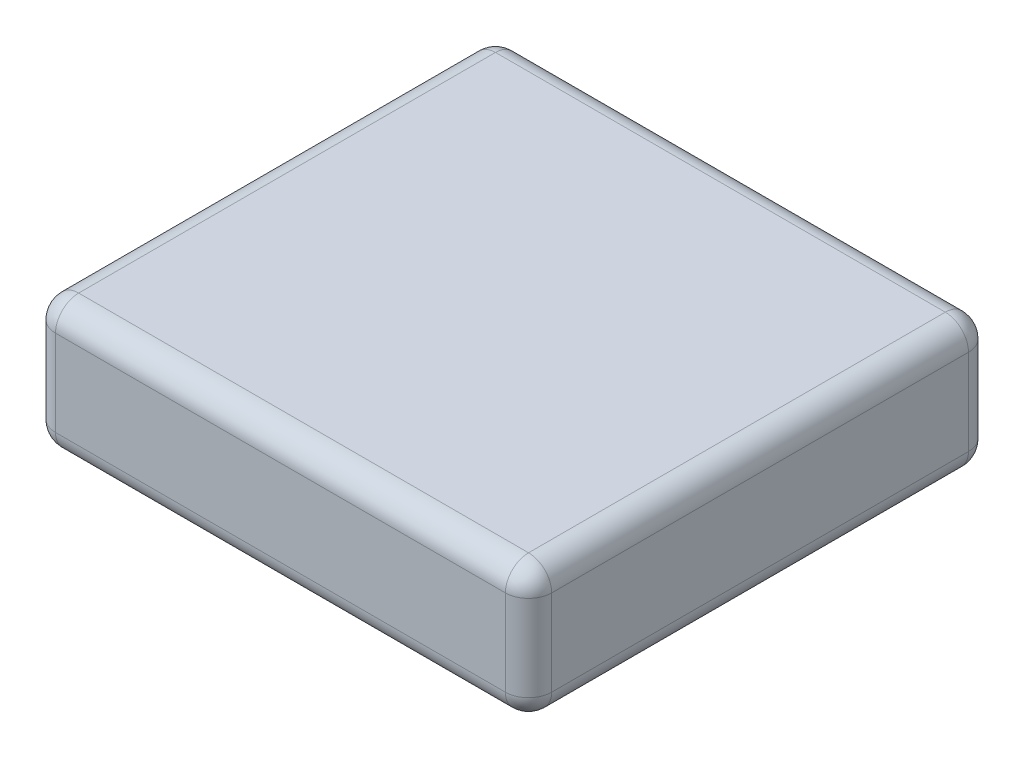
ISO-10303-21;
HEADER;
FILE_DESCRIPTION(('STEP AP214'),'2;1');
FILE_NAME('part.step','',(''),(''),'','','');
FILE_SCHEMA(('AUTOMOTIVE_DESIGN { 1 0 10303 214 1 1 1 1 }'));
ENDSEC;
DATA;
#1=APPLICATION_CONTEXT('core data for automotive mechanical design processes');
#2=APPLICATION_PROTOCOL_DEFINITION('international standard','automotive_design',2000,#1);
#3=PRODUCT_CONTEXT('',#1,'mechanical');
#4=PRODUCT('Part','Part','',(#3));
#5=PRODUCT_RELATED_PRODUCT_CATEGORY('part','',(#4));
#6=PRODUCT_DEFINITION_FORMATION('','',#4);
#7=PRODUCT_DEFINITION_CONTEXT('part definition',#1,'design');
#8=PRODUCT_DEFINITION('design','',#6,#7);
#9=PRODUCT_DEFINITION_SHAPE('','',#8);
#10=(LENGTH_UNIT() NAMED_UNIT(*) SI_UNIT(.MILLI.,.METRE.));
#11=(NAMED_UNIT(*) PLANE_ANGLE_UNIT() SI_UNIT($,.RADIAN.));
#12=(NAMED_UNIT(*) SI_UNIT($,.STERADIAN.) SOLID_ANGLE_UNIT());
#13=UNCERTAINTY_MEASURE_WITH_UNIT(LENGTH_MEASURE(1.E-05),#10,'distance_accuracy_value','');
#14=(GEOMETRIC_REPRESENTATION_CONTEXT(3) GLOBAL_UNCERTAINTY_ASSIGNED_CONTEXT((#13)) GLOBAL_UNIT_ASSIGNED_CONTEXT((#10,
#11,#12)) REPRESENTATION_CONTEXT('',''));
#15=CARTESIAN_POINT('',(0.,0.,0.));
#16=DIRECTION('',(0.,0.,1.));
#17=DIRECTION('',(1.,0.,0.));
#18=AXIS2_PLACEMENT_3D('',#15,#16,#17);
#19=CARTESIAN_POINT('',(506.552706552706,200.,-350.));
#20=DIRECTION('',(-1.,0.,0.));
#21=DIRECTION('',(0.,0.,1.));
#22=AXIS2_PLACEMENT_3D('',#19,#20,#21);
#23=PLANE('',#22);
#24=DIRECTION('',(0.,-1.,0.));
#25=VECTOR('',#24,1.);
#26=CARTESIAN_POINT('',(506.552706552706,200.,-315.));
#27=LINE('',#26,#25);
#28=CARTESIAN_POINT('',(506.552706552706,35.,-315.));
#29=VERTEX_POINT('',#28);
#30=CARTESIAN_POINT('',(506.552706552706,165.,-315.));
#31=VERTEX_POINT('',#30);
#32=EDGE_CURVE('E142',#29,#31,#27,.F.);
#33=ORIENTED_EDGE('',*,*,#32,.T.);
#34=DIRECTION('',(0.,0.,-1.));
#35=VECTOR('',#34,1.);
#36=CARTESIAN_POINT('',(506.552706552706,165.,350.));
#37=LINE('',#36,#35);
#38=CARTESIAN_POINT('',(506.552706552706,165.,315.));
#39=VERTEX_POINT('',#38);
#40=EDGE_CURVE('E188',#31,#39,#37,.F.);
#41=ORIENTED_EDGE('',*,*,#40,.T.);
#42=DIRECTION('',(0.,-1.,0.));
#43=VECTOR('',#42,1.);
#44=CARTESIAN_POINT('',(506.552706552706,200.,315.));
#45=LINE('',#44,#43);
#46=CARTESIAN_POINT('',(506.552706552706,35.,315.));
#47=VERTEX_POINT('',#46);
#48=EDGE_CURVE('E183',#39,#47,#45,.T.);
#49=ORIENTED_EDGE('',*,*,#48,.T.);
#50=DIRECTION('',(0.,0.,-1.));
#51=VECTOR('',#50,1.);
#52=CARTESIAN_POINT('',(506.552706552706,35.,-350.));
#53=LINE('',#52,#51);
#54=EDGE_CURVE('E177',#47,#29,#53,.T.);
#55=ORIENTED_EDGE('',*,*,#54,.T.);
#56=EDGE_LOOP('',(#33,#41,#49,#55));
#57=FACE_BOUND('',#56,.T.);
#58=ADVANCED_FACE('F45',(#57),#23,.F.);
#59=CARTESIAN_POINT('',(-243.447293447294,200.,-350.));
#60=DIRECTION('',(0.,0.,1.));
#61=DIRECTION('',(1.,0.,0.));
#62=AXIS2_PLACEMENT_3D('',#59,#60,#61);
#63=PLANE('',#62);
#64=DIRECTION('',(0.,-1.,0.));
#65=VECTOR('',#64,1.);
#66=CARTESIAN_POINT('',(-208.447293447294,200.,-350.));
#67=LINE('',#66,#65);
#68=CARTESIAN_POINT('',(-208.447293447294,35.,-350.));
#69=VERTEX_POINT('',#68);
#70=CARTESIAN_POINT('',(-208.447293447294,165.,-350.));
#71=VERTEX_POINT('',#70);
#72=EDGE_CURVE('E167',#69,#71,#67,.F.);
#73=ORIENTED_EDGE('',*,*,#72,.T.);
#74=DIRECTION('',(-1.,0.,0.));
#75=VECTOR('',#74,1.);
#76=CARTESIAN_POINT('',(506.552706552706,165.,-350.));
#77=LINE('',#76,#75);
#78=CARTESIAN_POINT('',(471.552706552706,165.,-350.));
#79=VERTEX_POINT('',#78);
#80=EDGE_CURVE('E171',#71,#79,#77,.F.);
#81=ORIENTED_EDGE('',*,*,#80,.T.);
#82=DIRECTION('',(0.,-1.,0.));
#83=VECTOR('',#82,1.);
#84=CARTESIAN_POINT('',(471.552706552706,200.,-350.));
#85=LINE('',#84,#83);
#86=CARTESIAN_POINT('',(471.552706552706,35.,-350.));
#87=VERTEX_POINT('',#86);
#88=EDGE_CURVE('E140',#79,#87,#85,.T.);
#89=ORIENTED_EDGE('',*,*,#88,.T.);
#90=DIRECTION('',(-1.,0.,0.));
#91=VECTOR('',#90,1.);
#92=CARTESIAN_POINT('',(-243.447293447294,35.,-350.));
#93=LINE('',#92,#91);
#94=EDGE_CURVE('E160',#87,#69,#93,.T.);
#95=ORIENTED_EDGE('',*,*,#94,.T.);
#96=EDGE_LOOP('',(#73,#81,#89,#95));
#97=FACE_BOUND('',#96,.T.);
#98=ADVANCED_FACE('F169',(#97),#63,.F.);
#99=CARTESIAN_POINT('',(-243.447293447294,200.,-350.));
#100=DIRECTION('',(1.,0.,0.));
#101=DIRECTION('',(0.,0.,-1.));
#102=AXIS2_PLACEMENT_3D('',#99,#100,#101);
#103=PLANE('',#102);
#104=DIRECTION('',(0.,-1.,0.));
#105=VECTOR('',#104,1.);
#106=CARTESIAN_POINT('',(-243.447293447294,200.,315.));
#107=LINE('',#106,#105);
#108=CARTESIAN_POINT('',(-243.447293447294,35.,315.));
#109=VERTEX_POINT('',#108);
#110=CARTESIAN_POINT('',(-243.447293447294,165.,315.));
#111=VERTEX_POINT('',#110);
#112=EDGE_CURVE('E194',#109,#111,#107,.F.);
#113=ORIENTED_EDGE('',*,*,#112,.T.);
#114=DIRECTION('',(0.,0.,1.));
#115=VECTOR('',#114,1.);
#116=CARTESIAN_POINT('',(-243.447293447294,165.,-350.));
#117=LINE('',#116,#115);
#118=CARTESIAN_POINT('',(-243.447293447294,165.,-315.));
#119=VERTEX_POINT('',#118);
#120=EDGE_CURVE('E201',#111,#119,#117,.F.);
#121=ORIENTED_EDGE('',*,*,#120,.T.);
#122=DIRECTION('',(0.,-1.,0.));
#123=VECTOR('',#122,1.);
#124=CARTESIAN_POINT('',(-243.447293447294,200.,-315.));
#125=LINE('',#124,#123);
#126=CARTESIAN_POINT('',(-243.447293447294,35.,-315.));
#127=VERTEX_POINT('',#126);
#128=EDGE_CURVE('E197',#119,#127,#125,.T.);
#129=ORIENTED_EDGE('',*,*,#128,.T.);
#130=DIRECTION('',(0.,0.,1.));
#131=VECTOR('',#130,1.);
#132=CARTESIAN_POINT('',(-243.447293447294,35.,-350.));
#133=LINE('',#132,#131);
#134=EDGE_CURVE('E191',#127,#109,#133,.T.);
#135=ORIENTED_EDGE('',*,*,#134,.T.);
#136=EDGE_LOOP('',(#113,#121,#129,#135));
#137=FACE_BOUND('',#136,.T.);
#138=ADVANCED_FACE('F340',(#137),#103,.F.);
#139=CARTESIAN_POINT('',(-243.447293447294,200.,350.));
#140=DIRECTION('',(0.,0.,-1.));
#141=DIRECTION('',(-1.,0.,0.));
#142=AXIS2_PLACEMENT_3D('',#139,#140,#141);
#143=PLANE('',#142);
#144=DIRECTION('',(0.,-1.,0.));
#145=VECTOR('',#144,1.);
#146=CARTESIAN_POINT('',(471.552706552706,200.,350.));
#147=LINE('',#146,#145);
#148=CARTESIAN_POINT('',(471.552706552706,35.,350.));
#149=VERTEX_POINT('',#148);
#150=CARTESIAN_POINT('',(471.552706552706,165.,350.));
#151=VERTEX_POINT('',#150);
#152=EDGE_CURVE('E207',#149,#151,#147,.F.);
#153=ORIENTED_EDGE('',*,*,#152,.T.);
#154=DIRECTION('',(1.,0.,0.));
#155=VECTOR('',#154,1.);
#156=CARTESIAN_POINT('',(-243.447293447294,165.,350.));
#157=LINE('',#156,#155);
#158=CARTESIAN_POINT('',(-208.447293447294,165.,350.));
#159=VERTEX_POINT('',#158);
#160=EDGE_CURVE('E214',#151,#159,#157,.F.);
#161=ORIENTED_EDGE('',*,*,#160,.T.);
#162=DIRECTION('',(0.,-1.,0.));
#163=VECTOR('',#162,1.);
#164=CARTESIAN_POINT('',(-208.447293447294,200.,350.));
#165=LINE('',#164,#163);
#166=CARTESIAN_POINT('',(-208.447293447294,35.,350.));
#167=VERTEX_POINT('',#166);
#168=EDGE_CURVE('E210',#159,#167,#165,.T.);
#169=ORIENTED_EDGE('',*,*,#168,.T.);
#170=DIRECTION('',(1.,0.,0.));
#171=VECTOR('',#170,1.);
#172=CARTESIAN_POINT('',(-243.447293447294,35.,350.));
#173=LINE('',#172,#171);
#174=EDGE_CURVE('E204',#167,#149,#173,.T.);
#175=ORIENTED_EDGE('',*,*,#174,.T.);
#176=EDGE_LOOP('',(#153,#161,#169,#175));
#177=FACE_BOUND('',#176,.T.);
#178=ADVANCED_FACE('F351',(#177),#143,.F.);
#179=CARTESIAN_POINT('',(0.,200.,0.));
#180=DIRECTION('',(0.,1.,0.));
#181=DIRECTION('',(0.,0.,1.));
#182=AXIS2_PLACEMENT_3D('',#179,#180,#181);
#183=PLANE('',#182);
#184=DIRECTION('',(0.,0.,1.));
#185=VECTOR('',#184,1.);
#186=CARTESIAN_POINT('',(-208.447293447294,200.,350.));
#187=LINE('',#186,#185);
#188=CARTESIAN_POINT('',(-208.447293447294,200.,-315.));
#189=VERTEX_POINT('',#188);
#190=CARTESIAN_POINT('',(-208.447293447294,200.,315.));
#191=VERTEX_POINT('',#190);
#192=EDGE_CURVE('E223',#189,#191,#187,.T.);
#193=ORIENTED_EDGE('',*,*,#192,.T.);
#194=DIRECTION('',(1.,0.,0.));
#195=VECTOR('',#194,1.);
#196=CARTESIAN_POINT('',(506.552706552706,200.,315.));
#197=LINE('',#196,#195);
#198=CARTESIAN_POINT('',(471.552706552706,200.,315.));
#199=VERTEX_POINT('',#198);
#200=EDGE_CURVE('E226',#191,#199,#197,.T.);
#201=ORIENTED_EDGE('',*,*,#200,.T.);
#202=DIRECTION('',(0.,0.,-1.));
#203=VECTOR('',#202,1.);
#204=CARTESIAN_POINT('',(471.552706552706,200.,-350.));
#205=LINE('',#204,#203);
#206=CARTESIAN_POINT('',(471.552706552706,200.,-315.));
#207=VERTEX_POINT('',#206);
#208=EDGE_CURVE('E217',#199,#207,#205,.T.);
#209=ORIENTED_EDGE('',*,*,#208,.T.);
#210=DIRECTION('',(-1.,0.,0.));
#211=VECTOR('',#210,1.);
#212=CARTESIAN_POINT('',(-243.447293447294,200.,-315.));
#213=LINE('',#212,#211);
#214=EDGE_CURVE('E220',#207,#189,#213,.T.);
#215=ORIENTED_EDGE('',*,*,#214,.T.);
#216=EDGE_LOOP('',(#193,#201,#209,#215));
#217=FACE_BOUND('',#216,.T.);
#218=ADVANCED_FACE('F332',(#217),#183,.T.);
#219=CARTESIAN_POINT('',(0.,0.,0.));
#220=DIRECTION('',(0.,1.,0.));
#221=DIRECTION('',(0.,0.,1.));
#222=AXIS2_PLACEMENT_3D('',#219,#220,#221);
#223=PLANE('',#222);
#224=DIRECTION('',(0.,0.,1.));
#225=VECTOR('',#224,1.);
#226=CARTESIAN_POINT('',(-208.447293447294,0.,0.));
#227=LINE('',#226,#225);
#228=CARTESIAN_POINT('',(-208.447293447294,0.,315.));
#229=VERTEX_POINT('',#228);
#230=CARTESIAN_POINT('',(-208.447293447294,0.,-315.));
#231=VERTEX_POINT('',#230);
#232=EDGE_CURVE('E55',#229,#231,#227,.F.);
#233=ORIENTED_EDGE('',*,*,#232,.T.);
#234=DIRECTION('',(-1.,0.,0.));
#235=VECTOR('',#234,1.);
#236=CARTESIAN_POINT('',(0.,0.,-315.));
#237=LINE('',#236,#235);
#238=CARTESIAN_POINT('',(471.552706552706,0.,-315.));
#239=VERTEX_POINT('',#238);
#240=EDGE_CURVE('E11',#231,#239,#237,.F.);
#241=ORIENTED_EDGE('',*,*,#240,.T.);
#242=DIRECTION('',(0.,0.,-1.));
#243=VECTOR('',#242,1.);
#244=CARTESIAN_POINT('',(471.552706552706,0.,0.));
#245=LINE('',#244,#243);
#246=CARTESIAN_POINT('',(471.552706552706,0.,315.));
#247=VERTEX_POINT('',#246);
#248=EDGE_CURVE('E230',#239,#247,#245,.F.);
#249=ORIENTED_EDGE('',*,*,#248,.T.);
#250=DIRECTION('',(1.,0.,0.));
#251=VECTOR('',#250,1.);
#252=CARTESIAN_POINT('',(0.,0.,315.));
#253=LINE('',#252,#251);
#254=EDGE_CURVE('E66',#247,#229,#253,.F.);
#255=ORIENTED_EDGE('',*,*,#254,.T.);
#256=EDGE_LOOP('',(#233,#241,#249,#255));
#257=FACE_BOUND('',#256,.T.);
#258=ADVANCED_FACE('F577',(#257),#223,.F.);
#259=CARTESIAN_POINT('',(-208.447293447294,200.,315.));
#260=DIRECTION('',(0.,-1.,0.));
#261=DIRECTION('',(0.,0.,-1.));
#262=AXIS2_PLACEMENT_3D('',#259,#260,#261);
#263=CYLINDRICAL_SURFACE('',#262,35.);
#264=CARTESIAN_POINT('',(-208.447293447294,165.,315.));
#265=DIRECTION('',(0.,1.,0.));
#266=DIRECTION('',(0.,0.,1.));
#267=AXIS2_PLACEMENT_3D('',#264,#265,#266);
#268=CIRCLE('',#267,35.);
#269=EDGE_CURVE('E49',#111,#159,#268,.T.);
#270=ORIENTED_EDGE('',*,*,#269,.F.);
#271=ORIENTED_EDGE('',*,*,#112,.F.);
#272=CARTESIAN_POINT('',(-208.447293447294,35.,315.));
#273=DIRECTION('',(0.,-1.,0.));
#274=DIRECTION('',(0.,0.,-1.));
#275=AXIS2_PLACEMENT_3D('',#272,#273,#274);
#276=CIRCLE('',#275,35.);
#277=EDGE_CURVE('E307',#167,#109,#276,.T.);
#278=ORIENTED_EDGE('',*,*,#277,.F.);
#279=ORIENTED_EDGE('',*,*,#168,.F.);
#280=EDGE_LOOP('',(#270,#271,#278,#279));
#281=FACE_BOUND('',#280,.T.);
#282=ADVANCED_FACE('F47',(#281),#263,.T.);
#283=CARTESIAN_POINT('',(-208.447293447294,165.,315.));
#284=DIRECTION('',(0.,0.,1.));
#285=DIRECTION('',(1.,0.,0.));
#286=AXIS2_PLACEMENT_3D('',#283,#284,#285);
#287=SPHERICAL_SURFACE('',#286,35.);
#288=CARTESIAN_POINT('',(-208.447293447294,165.,315.));
#289=DIRECTION('',(0.,0.,1.));
#290=DIRECTION('',(1.,0.,0.));
#291=AXIS2_PLACEMENT_3D('',#288,#289,#290);
#292=CIRCLE('',#291,35.);
#293=EDGE_CURVE('E300',#111,#191,#292,.F.);
#294=ORIENTED_EDGE('',*,*,#293,.F.);
#295=ORIENTED_EDGE('',*,*,#269,.T.);
#296=CARTESIAN_POINT('',(-208.447293447294,165.,315.));
#297=DIRECTION('',(-1.,0.,0.));
#298=DIRECTION('',(0.,0.,1.));
#299=AXIS2_PLACEMENT_3D('',#296,#297,#298);
#300=CIRCLE('',#299,35.);
#301=EDGE_CURVE('E304',#191,#159,#300,.F.);
#302=ORIENTED_EDGE('',*,*,#301,.F.);
#303=EDGE_LOOP('',(#294,#295,#302));
#304=FACE_BOUND('',#303,.T.);
#305=ADVANCED_FACE('F320',(#304),#287,.T.);
#306=CARTESIAN_POINT('',(-208.447293447294,35.,315.));
#307=DIRECTION('',(-1.,0.,0.));
#308=DIRECTION('',(0.,0.,1.));
#309=AXIS2_PLACEMENT_3D('',#306,#307,#308);
#310=SPHERICAL_SURFACE('',#309,35.);
#311=CARTESIAN_POINT('',(-208.447293447294,35.,315.));
#312=DIRECTION('',(-1.,0.,0.));
#313=DIRECTION('',(0.,0.,1.));
#314=AXIS2_PLACEMENT_3D('',#311,#312,#313);
#315=CIRCLE('',#314,35.);
#316=EDGE_CURVE('E293',#167,#229,#315,.F.);
#317=ORIENTED_EDGE('',*,*,#316,.F.);
#318=ORIENTED_EDGE('',*,*,#277,.T.);
#319=CARTESIAN_POINT('',(-208.447293447294,35.,315.));
#320=DIRECTION('',(0.,0.,1.));
#321=DIRECTION('',(1.,0.,0.));
#322=AXIS2_PLACEMENT_3D('',#319,#320,#321);
#323=CIRCLE('',#322,35.);
#324=EDGE_CURVE('E296',#229,#109,#323,.F.);
#325=ORIENTED_EDGE('',*,*,#324,.F.);
#326=EDGE_LOOP('',(#317,#318,#325));
#327=FACE_BOUND('',#326,.T.);
#328=ADVANCED_FACE('F550',(#327),#310,.T.);
#329=CARTESIAN_POINT('',(0.,165.,315.));
#330=DIRECTION('',(-1.,0.,0.));
#331=DIRECTION('',(0.,0.,1.));
#332=AXIS2_PLACEMENT_3D('',#329,#330,#331);
#333=CYLINDRICAL_SURFACE('',#332,35.);
#334=ORIENTED_EDGE('',*,*,#301,.T.);
#335=ORIENTED_EDGE('',*,*,#160,.F.);
#336=CARTESIAN_POINT('',(471.552706552706,165.,315.));
#337=DIRECTION('',(1.,0.,0.));
#338=DIRECTION('',(0.,0.,-1.));
#339=AXIS2_PLACEMENT_3D('',#336,#337,#338);
#340=CIRCLE('',#339,35.);
#341=EDGE_CURVE('E285',#199,#151,#340,.T.);
#342=ORIENTED_EDGE('',*,*,#341,.F.);
#343=ORIENTED_EDGE('',*,*,#200,.F.);
#344=EDGE_LOOP('',(#334,#335,#342,#343));
#345=FACE_BOUND('',#344,.T.);
#346=ADVANCED_FACE('F328',(#345),#333,.T.);
#347=CARTESIAN_POINT('',(-208.447293447294,165.,0.));
#348=DIRECTION('',(0.,0.,-1.));
#349=DIRECTION('',(-1.,0.,0.));
#350=AXIS2_PLACEMENT_3D('',#347,#348,#349);
#351=CYLINDRICAL_SURFACE('',#350,35.);
#352=ORIENTED_EDGE('',*,*,#293,.T.);
#353=ORIENTED_EDGE('',*,*,#192,.F.);
#354=CARTESIAN_POINT('',(-208.447293447294,165.,-315.));
#355=DIRECTION('',(0.,0.,-1.));
#356=DIRECTION('',(-1.,0.,0.));
#357=AXIS2_PLACEMENT_3D('',#354,#355,#356);
#358=CIRCLE('',#357,35.);
#359=EDGE_CURVE('E281',#119,#189,#358,.T.);
#360=ORIENTED_EDGE('',*,*,#359,.F.);
#361=ORIENTED_EDGE('',*,*,#120,.F.);
#362=EDGE_LOOP('',(#352,#353,#360,#361));
#363=FACE_BOUND('',#362,.T.);
#364=ADVANCED_FACE('F337',(#363),#351,.T.);
#365=CARTESIAN_POINT('',(-208.447293447294,200.,-315.));
#366=DIRECTION('',(0.,-1.,0.));
#367=DIRECTION('',(0.,0.,-1.));
#368=AXIS2_PLACEMENT_3D('',#365,#366,#367);
#369=CYLINDRICAL_SURFACE('',#368,35.);
#370=CARTESIAN_POINT('',(-208.447293447294,35.,-315.));
#371=DIRECTION('',(0.,-1.,0.));
#372=DIRECTION('',(0.,0.,-1.));
#373=AXIS2_PLACEMENT_3D('',#370,#371,#372);
#374=CIRCLE('',#373,35.);
#375=EDGE_CURVE('E273',#127,#69,#374,.T.);
#376=ORIENTED_EDGE('',*,*,#375,.F.);
#377=ORIENTED_EDGE('',*,*,#128,.F.);
#378=CARTESIAN_POINT('',(-208.447293447294,165.,-315.));
#379=DIRECTION('',(0.,1.,0.));
#380=DIRECTION('',(0.,0.,1.));
#381=AXIS2_PLACEMENT_3D('',#378,#379,#380);
#382=CIRCLE('',#381,35.);
#383=EDGE_CURVE('E277',#71,#119,#382,.T.);
#384=ORIENTED_EDGE('',*,*,#383,.F.);
#385=ORIENTED_EDGE('',*,*,#72,.F.);
#386=EDGE_LOOP('',(#376,#377,#384,#385));
#387=FACE_BOUND('',#386,.T.);
#388=ADVANCED_FACE('F344',(#387),#369,.T.);
#389=CARTESIAN_POINT('',(-208.447293447294,35.,-350.));
#390=DIRECTION('',(0.,0.,1.));
#391=DIRECTION('',(1.,0.,0.));
#392=AXIS2_PLACEMENT_3D('',#389,#390,#391);
#393=CYLINDRICAL_SURFACE('',#392,35.);
#394=ORIENTED_EDGE('',*,*,#324,.T.);
#395=ORIENTED_EDGE('',*,*,#134,.F.);
#396=CARTESIAN_POINT('',(-208.447293447294,35.,-315.));
#397=DIRECTION('',(0.,0.,-1.));
#398=DIRECTION('',(-1.,0.,0.));
#399=AXIS2_PLACEMENT_3D('',#396,#397,#398);
#400=CIRCLE('',#399,35.);
#401=EDGE_CURVE('E270',#231,#127,#400,.T.);
#402=ORIENTED_EDGE('',*,*,#401,.F.);
#403=ORIENTED_EDGE('',*,*,#232,.F.);
#404=EDGE_LOOP('',(#394,#395,#402,#403));
#405=FACE_BOUND('',#404,.T.);
#406=ADVANCED_FACE('F349',(#405),#393,.T.);
#407=CARTESIAN_POINT('',(-243.447293447294,35.,315.));
#408=DIRECTION('',(1.,0.,0.));
#409=DIRECTION('',(0.,0.,-1.));
#410=AXIS2_PLACEMENT_3D('',#407,#408,#409);
#411=CYLINDRICAL_SURFACE('',#410,35.);
#412=ORIENTED_EDGE('',*,*,#316,.T.);
#413=ORIENTED_EDGE('',*,*,#254,.F.);
#414=CARTESIAN_POINT('',(471.552706552706,35.,315.));
#415=DIRECTION('',(1.,0.,0.));
#416=DIRECTION('',(0.,0.,-1.));
#417=AXIS2_PLACEMENT_3D('',#414,#415,#416);
#418=CIRCLE('',#417,35.);
#419=EDGE_CURVE('E266',#149,#247,#418,.T.);
#420=ORIENTED_EDGE('',*,*,#419,.F.);
#421=ORIENTED_EDGE('',*,*,#174,.F.);
#422=EDGE_LOOP('',(#412,#413,#420,#421));
#423=FACE_BOUND('',#422,.T.);
#424=ADVANCED_FACE('F360',(#423),#411,.T.);
#425=CARTESIAN_POINT('',(471.552706552706,200.,315.));
#426=DIRECTION('',(0.,-1.,0.));
#427=DIRECTION('',(0.,0.,-1.));
#428=AXIS2_PLACEMENT_3D('',#425,#426,#427);
#429=CYLINDRICAL_SURFACE('',#428,35.);
#430=CARTESIAN_POINT('',(471.552706552706,165.,315.));
#431=DIRECTION('',(0.,1.,0.));
#432=DIRECTION('',(0.,0.,1.));
#433=AXIS2_PLACEMENT_3D('',#430,#431,#432);
#434=CIRCLE('',#433,35.);
#435=EDGE_CURVE('E289',#151,#39,#434,.T.);
#436=ORIENTED_EDGE('',*,*,#435,.F.);
#437=ORIENTED_EDGE('',*,*,#152,.F.);
#438=CARTESIAN_POINT('',(471.552706552706,35.,315.));
#439=DIRECTION('',(0.,-1.,0.));
#440=DIRECTION('',(0.,0.,-1.));
#441=AXIS2_PLACEMENT_3D('',#438,#439,#440);
#442=CIRCLE('',#441,35.);
#443=EDGE_CURVE('E262',#47,#149,#442,.T.);
#444=ORIENTED_EDGE('',*,*,#443,.F.);
#445=ORIENTED_EDGE('',*,*,#48,.F.);
#446=EDGE_LOOP('',(#436,#437,#444,#445));
#447=FACE_BOUND('',#446,.T.);
#448=ADVANCED_FACE('F356',(#447),#429,.T.);
#449=CARTESIAN_POINT('',(471.552706552706,165.,315.));
#450=DIRECTION('',(0.,0.,1.));
#451=DIRECTION('',(1.,0.,0.));
#452=AXIS2_PLACEMENT_3D('',#449,#450,#451);
#453=SPHERICAL_SURFACE('',#452,35.);
#454=ORIENTED_EDGE('',*,*,#341,.T.);
#455=ORIENTED_EDGE('',*,*,#435,.T.);
#456=CARTESIAN_POINT('',(471.552706552706,165.,315.));
#457=DIRECTION('',(0.,0.,1.));
#458=DIRECTION('',(1.,0.,0.));
#459=AXIS2_PLACEMENT_3D('',#456,#457,#458);
#460=CIRCLE('',#459,35.);
#461=EDGE_CURVE('E258',#199,#39,#460,.F.);
#462=ORIENTED_EDGE('',*,*,#461,.F.);
#463=EDGE_LOOP('',(#454,#455,#462));
#464=FACE_BOUND('',#463,.T.);
#465=ADVANCED_FACE('F370',(#464),#453,.T.);
#466=CARTESIAN_POINT('',(-208.447293447294,165.,-315.));
#467=DIRECTION('',(-1.,0.,0.));
#468=DIRECTION('',(0.,0.,1.));
#469=AXIS2_PLACEMENT_3D('',#466,#467,#468);
#470=SPHERICAL_SURFACE('',#469,35.);
#471=ORIENTED_EDGE('',*,*,#383,.T.);
#472=ORIENTED_EDGE('',*,*,#359,.T.);
#473=CARTESIAN_POINT('',(-208.447293447294,165.,-315.));
#474=DIRECTION('',(-1.,0.,0.));
#475=DIRECTION('',(0.,0.,1.));
#476=AXIS2_PLACEMENT_3D('',#473,#474,#475);
#477=CIRCLE('',#476,35.);
#478=EDGE_CURVE('E254',#71,#189,#477,.F.);
#479=ORIENTED_EDGE('',*,*,#478,.F.);
#480=EDGE_LOOP('',(#471,#472,#479));
#481=FACE_BOUND('',#480,.T.);
#482=ADVANCED_FACE('F380',(#481),#470,.T.);
#483=CARTESIAN_POINT('',(-208.447293447294,35.,-315.));
#484=DIRECTION('',(-1.,0.,0.));
#485=DIRECTION('',(0.,0.,1.));
#486=AXIS2_PLACEMENT_3D('',#483,#484,#485);
#487=SPHERICAL_SURFACE('',#486,35.);
#488=ORIENTED_EDGE('',*,*,#401,.T.);
#489=ORIENTED_EDGE('',*,*,#375,.T.);
#490=CARTESIAN_POINT('',(-208.447293447294,35.,-315.));
#491=DIRECTION('',(-1.,0.,0.));
#492=DIRECTION('',(0.,0.,1.));
#493=AXIS2_PLACEMENT_3D('',#490,#491,#492);
#494=CIRCLE('',#493,35.);
#495=EDGE_CURVE('E163',#231,#69,#494,.F.);
#496=ORIENTED_EDGE('',*,*,#495,.F.);
#497=EDGE_LOOP('',(#488,#489,#496));
#498=FACE_BOUND('',#497,.T.);
#499=ADVANCED_FACE('F382',(#498),#487,.T.);
#500=CARTESIAN_POINT('',(471.552706552706,35.,315.));
#501=DIRECTION('',(0.,0.,1.));
#502=DIRECTION('',(1.,0.,0.));
#503=AXIS2_PLACEMENT_3D('',#500,#501,#502);
#504=SPHERICAL_SURFACE('',#503,35.);
#505=ORIENTED_EDGE('',*,*,#443,.T.);
#506=ORIENTED_EDGE('',*,*,#419,.T.);
#507=CARTESIAN_POINT('',(471.552706552706,35.,315.));
#508=DIRECTION('',(0.,0.,1.));
#509=DIRECTION('',(1.,0.,0.));
#510=AXIS2_PLACEMENT_3D('',#507,#508,#509);
#511=CIRCLE('',#510,35.);
#512=EDGE_CURVE('E248',#47,#247,#511,.F.);
#513=ORIENTED_EDGE('',*,*,#512,.F.);
#514=EDGE_LOOP('',(#505,#506,#513));
#515=FACE_BOUND('',#514,.T.);
#516=ADVANCED_FACE('F362',(#515),#504,.T.);
#517=CARTESIAN_POINT('',(471.552706552706,165.,0.));
#518=DIRECTION('',(0.,0.,1.));
#519=DIRECTION('',(1.,0.,0.));
#520=AXIS2_PLACEMENT_3D('',#517,#518,#519);
#521=CYLINDRICAL_SURFACE('',#520,35.);
#522=ORIENTED_EDGE('',*,*,#461,.T.);
#523=ORIENTED_EDGE('',*,*,#40,.F.);
#524=CARTESIAN_POINT('',(471.552706552706,165.,-315.));
#525=DIRECTION('',(0.,0.,-1.));
#526=DIRECTION('',(-1.,0.,0.));
#527=AXIS2_PLACEMENT_3D('',#524,#525,#526);
#528=CIRCLE('',#527,35.);
#529=EDGE_CURVE('E244',#207,#31,#528,.T.);
#530=ORIENTED_EDGE('',*,*,#529,.F.);
#531=ORIENTED_EDGE('',*,*,#208,.F.);
#532=EDGE_LOOP('',(#522,#523,#530,#531));
#533=FACE_BOUND('',#532,.T.);
#534=ADVANCED_FACE('F372',(#533),#521,.T.);
#535=CARTESIAN_POINT('',(0.,165.,-315.));
#536=DIRECTION('',(1.,0.,0.));
#537=DIRECTION('',(0.,0.,-1.));
#538=AXIS2_PLACEMENT_3D('',#535,#536,#537);
#539=CYLINDRICAL_SURFACE('',#538,35.);
#540=ORIENTED_EDGE('',*,*,#478,.T.);
#541=ORIENTED_EDGE('',*,*,#214,.F.);
#542=CARTESIAN_POINT('',(471.552706552706,165.,-315.));
#543=DIRECTION('',(1.,0.,0.));
#544=DIRECTION('',(0.,0.,-1.));
#545=AXIS2_PLACEMENT_3D('',#542,#543,#544);
#546=CIRCLE('',#545,35.);
#547=EDGE_CURVE('E157',#79,#207,#546,.T.);
#548=ORIENTED_EDGE('',*,*,#547,.F.);
#549=ORIENTED_EDGE('',*,*,#80,.F.);
#550=EDGE_LOOP('',(#540,#541,#548,#549));
#551=FACE_BOUND('',#550,.T.);
#552=ADVANCED_FACE('F378',(#551),#539,.T.);
#553=CARTESIAN_POINT('',(-243.447293447294,35.,-315.));
#554=DIRECTION('',(-1.,0.,0.));
#555=DIRECTION('',(0.,0.,1.));
#556=AXIS2_PLACEMENT_3D('',#553,#554,#555);
#557=CYLINDRICAL_SURFACE('',#556,35.);
#558=ORIENTED_EDGE('',*,*,#495,.T.);
#559=ORIENTED_EDGE('',*,*,#94,.F.);
#560=CARTESIAN_POINT('',(471.552706552706,35.,-315.));
#561=DIRECTION('',(1.,0.,0.));
#562=DIRECTION('',(0.,0.,-1.));
#563=AXIS2_PLACEMENT_3D('',#560,#561,#562);
#564=CIRCLE('',#563,35.);
#565=EDGE_CURVE('E148',#239,#87,#564,.T.);
#566=ORIENTED_EDGE('',*,*,#565,.F.);
#567=ORIENTED_EDGE('',*,*,#240,.F.);
#568=EDGE_LOOP('',(#558,#559,#566,#567));
#569=FACE_BOUND('',#568,.T.);
#570=ADVANCED_FACE('F161',(#569),#557,.T.);
#571=CARTESIAN_POINT('',(471.552706552706,35.,-350.));
#572=DIRECTION('',(0.,0.,-1.));
#573=DIRECTION('',(-1.,0.,0.));
#574=AXIS2_PLACEMENT_3D('',#571,#572,#573);
#575=CYLINDRICAL_SURFACE('',#574,35.);
#576=ORIENTED_EDGE('',*,*,#512,.T.);
#577=ORIENTED_EDGE('',*,*,#248,.F.);
#578=CARTESIAN_POINT('',(471.552706552706,35.,-315.));
#579=DIRECTION('',(0.,0.,-1.));
#580=DIRECTION('',(-1.,0.,0.));
#581=AXIS2_PLACEMENT_3D('',#578,#579,#580);
#582=CIRCLE('',#581,35.);
#583=EDGE_CURVE('E152',#29,#239,#582,.T.);
#584=ORIENTED_EDGE('',*,*,#583,.F.);
#585=ORIENTED_EDGE('',*,*,#54,.F.);
#586=EDGE_LOOP('',(#576,#577,#584,#585));
#587=FACE_BOUND('',#586,.T.);
#588=ADVANCED_FACE('F365',(#587),#575,.T.);
#589=CARTESIAN_POINT('',(471.552706552706,165.,-315.));
#590=DIRECTION('',(0.,1.,0.));
#591=DIRECTION('',(0.,0.,1.));
#592=AXIS2_PLACEMENT_3D('',#589,#590,#591);
#593=SPHERICAL_SURFACE('',#592,35.);
#594=ORIENTED_EDGE('',*,*,#547,.T.);
#595=ORIENTED_EDGE('',*,*,#529,.T.);
#596=CARTESIAN_POINT('',(471.552706552706,165.,-315.));
#597=DIRECTION('',(0.,1.,0.));
#598=DIRECTION('',(0.,0.,1.));
#599=AXIS2_PLACEMENT_3D('',#596,#597,#598);
#600=CIRCLE('',#599,35.);
#601=EDGE_CURVE('E145',#79,#31,#600,.F.);
#602=ORIENTED_EDGE('',*,*,#601,.F.);
#603=EDGE_LOOP('',(#594,#595,#602));
#604=FACE_BOUND('',#603,.T.);
#605=ADVANCED_FACE('F376',(#604),#593,.T.);
#606=CARTESIAN_POINT('',(471.552706552706,35.,-315.));
#607=DIRECTION('',(0.,-1.,0.));
#608=DIRECTION('',(0.,0.,-1.));
#609=AXIS2_PLACEMENT_3D('',#606,#607,#608);
#610=SPHERICAL_SURFACE('',#609,35.);
#611=ORIENTED_EDGE('',*,*,#583,.T.);
#612=ORIENTED_EDGE('',*,*,#565,.T.);
#613=CARTESIAN_POINT('',(471.552706552706,35.,-315.));
#614=DIRECTION('',(0.,-1.,0.));
#615=DIRECTION('',(0.,0.,-1.));
#616=AXIS2_PLACEMENT_3D('',#613,#614,#615);
#617=CIRCLE('',#616,35.);
#618=EDGE_CURVE('E136',#29,#87,#617,.F.);
#619=ORIENTED_EDGE('',*,*,#618,.F.);
#620=EDGE_LOOP('',(#611,#612,#619));
#621=FACE_BOUND('',#620,.T.);
#622=ADVANCED_FACE('F150',(#621),#610,.T.);
#623=CARTESIAN_POINT('',(471.552706552706,200.,-315.));
#624=DIRECTION('',(0.,-1.,0.));
#625=DIRECTION('',(0.,0.,-1.));
#626=AXIS2_PLACEMENT_3D('',#623,#624,#625);
#627=CYLINDRICAL_SURFACE('',#626,35.);
#628=ORIENTED_EDGE('',*,*,#601,.T.);
#629=ORIENTED_EDGE('',*,*,#32,.F.);
#630=ORIENTED_EDGE('',*,*,#618,.T.);
#631=ORIENTED_EDGE('',*,*,#88,.F.);
#632=EDGE_LOOP('',(#628,#629,#630,#631));
#633=FACE_BOUND('',#632,.T.);
#634=ADVANCED_FACE('F138',(#633),#627,.T.);
#635=CLOSED_SHELL('',(#58,#98,#138,#178,#218,#258,#282,#305,#328,#346,#364,#388,#406,#424,#448,
#465,#482,#499,#516,#534,#552,#570,#588,#605,#622,#634));
#636=MANIFOLD_SOLID_BREP('B2',#635);
#637=ADVANCED_BREP_SHAPE_REPRESENTATION('',(#18,#636),#14);
#638=SHAPE_DEFINITION_REPRESENTATION(#9,#637);
ENDSEC;
END-ISO-10303-21;
